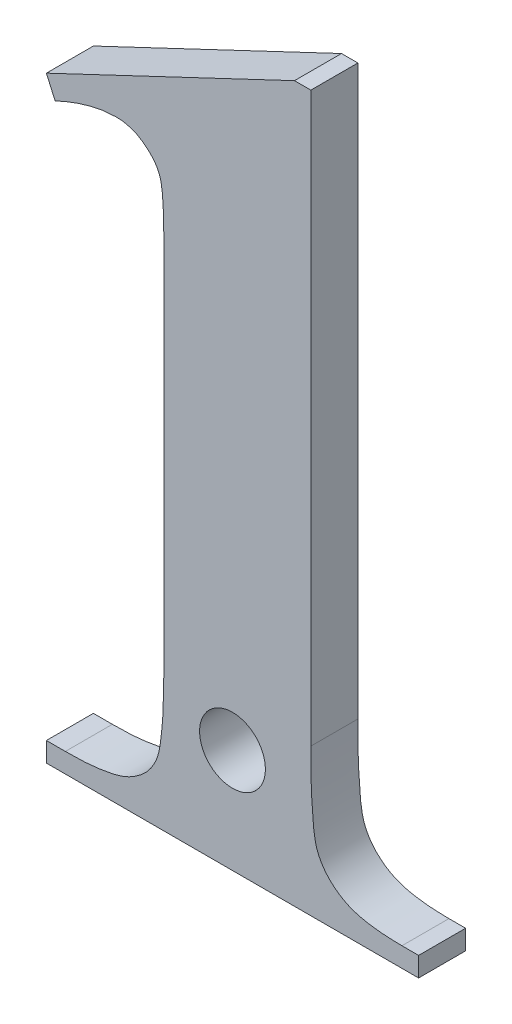
ISO-10303-21;
HEADER;
FILE_DESCRIPTION(('STEP AP214'),'2;1');
FILE_NAME('part.step','',(''),(''),'','','');
FILE_SCHEMA(('AUTOMOTIVE_DESIGN { 1 0 10303 214 1 1 1 1 }'));
ENDSEC;
DATA;
#1=APPLICATION_CONTEXT('core data for automotive mechanical design processes');
#2=APPLICATION_PROTOCOL_DEFINITION('international standard','automotive_design',2000,#1);
#3=PRODUCT_CONTEXT('',#1,'mechanical');
#4=PRODUCT('Part','Part','',(#3));
#5=PRODUCT_RELATED_PRODUCT_CATEGORY('part','',(#4));
#6=PRODUCT_DEFINITION_FORMATION('','',#4);
#7=PRODUCT_DEFINITION_CONTEXT('part definition',#1,'design');
#8=PRODUCT_DEFINITION('design','',#6,#7);
#9=PRODUCT_DEFINITION_SHAPE('','',#8);
#10=(LENGTH_UNIT() NAMED_UNIT(*) SI_UNIT(.MILLI.,.METRE.));
#11=(NAMED_UNIT(*) PLANE_ANGLE_UNIT() SI_UNIT($,.RADIAN.));
#12=(NAMED_UNIT(*) SI_UNIT($,.STERADIAN.) SOLID_ANGLE_UNIT());
#13=UNCERTAINTY_MEASURE_WITH_UNIT(LENGTH_MEASURE(1.E-05),#10,'distance_accuracy_value','');
#14=(GEOMETRIC_REPRESENTATION_CONTEXT(3) GLOBAL_UNCERTAINTY_ASSIGNED_CONTEXT((#13)) GLOBAL_UNIT_ASSIGNED_CONTEXT((#10,
#11,#12)) REPRESENTATION_CONTEXT('',''));
#15=CARTESIAN_POINT('',(0.,0.,0.));
#16=DIRECTION('',(0.,0.,1.));
#17=DIRECTION('',(1.,0.,0.));
#18=AXIS2_PLACEMENT_3D('',#15,#16,#17);
#19=CARTESIAN_POINT('',(13.88671875,30.4166666666667,2.));
#20=DIRECTION('',(0.,1.,0.));
#21=DIRECTION('',(0.,0.,1.));
#22=AXIS2_PLACEMENT_3D('',#19,#20,#21);
#23=PLANE('',#22);
#24=DIRECTION('',(1.,0.,0.));
#25=VECTOR('',#24,1.);
#26=CARTESIAN_POINT('',(13.88671875,30.4166666666667,0.));
#27=LINE('',#26,#25);
#28=CARTESIAN_POINT('',(13.88671875,30.4166666666667,0.));
#29=VERTEX_POINT('',#28);
#30=CARTESIAN_POINT('',(14.5833333333333,30.4166666666667,0.));
#31=VERTEX_POINT('',#30);
#32=EDGE_CURVE('E242',#29,#31,#27,.T.);
#33=ORIENTED_EDGE('',*,*,#32,.F.);
#34=DIRECTION('',(0.,0.,-1.));
#35=VECTOR('',#34,1.);
#36=CARTESIAN_POINT('',(13.88671875,30.4166666666667,2.));
#37=LINE('',#36,#35);
#38=CARTESIAN_POINT('',(13.88671875,30.4166666666667,2.));
#39=VERTEX_POINT('',#38);
#40=EDGE_CURVE('E11',#39,#29,#37,.T.);
#41=ORIENTED_EDGE('',*,*,#40,.F.);
#42=DIRECTION('',(1.,0.,0.));
#43=VECTOR('',#42,1.);
#44=CARTESIAN_POINT('',(13.88671875,30.4166666666667,2.));
#45=LINE('',#44,#43);
#46=CARTESIAN_POINT('',(14.5833333333333,30.4166666666667,2.));
#47=VERTEX_POINT('',#46);
#48=EDGE_CURVE('E297',#39,#47,#45,.T.);
#49=ORIENTED_EDGE('',*,*,#48,.T.);
#50=DIRECTION('',(0.,0.,-1.));
#51=VECTOR('',#50,1.);
#52=CARTESIAN_POINT('',(14.5833333333333,30.4166666666667,2.));
#53=LINE('',#52,#51);
#54=EDGE_CURVE('E111',#47,#31,#53,.T.);
#55=ORIENTED_EDGE('',*,*,#54,.T.);
#56=EDGE_LOOP('',(#33,#41,#49,#55));
#57=FACE_BOUND('',#56,.T.);
#58=ADVANCED_FACE('F37',(#57),#23,.T.);
#59=CARTESIAN_POINT('',(3.33333333333333,25.4166666666667,2.));
#60=DIRECTION('',(-0.428158237884948,0.903703780744142,0.));
#61=DIRECTION('',(-0.903703780744142,-0.428158237884948,0.));
#62=AXIS2_PLACEMENT_3D('',#59,#60,#61);
#63=PLANE('',#62);
#64=DIRECTION('',(0.903703780744142,0.428158237884948,0.));
#65=VECTOR('',#64,1.);
#66=CARTESIAN_POINT('',(3.33333333333333,25.4166666666667,0.));
#67=LINE('',#66,#65);
#68=CARTESIAN_POINT('',(3.33333333333333,25.4166666666667,0.));
#69=VERTEX_POINT('',#68);
#70=EDGE_CURVE('E295',#69,#29,#67,.T.);
#71=ORIENTED_EDGE('',*,*,#70,.F.);
#72=DIRECTION('',(0.,0.,-1.));
#73=VECTOR('',#72,1.);
#74=CARTESIAN_POINT('',(3.33333333333333,25.4166666666667,2.));
#75=LINE('',#74,#73);
#76=CARTESIAN_POINT('',(3.33333333333333,25.4166666666667,2.));
#77=VERTEX_POINT('',#76);
#78=EDGE_CURVE('E46',#77,#69,#75,.T.);
#79=ORIENTED_EDGE('',*,*,#78,.F.);
#80=DIRECTION('',(0.903703780744142,0.428158237884948,0.));
#81=VECTOR('',#80,1.);
#82=CARTESIAN_POINT('',(3.33333333333333,25.4166666666667,2.));
#83=LINE('',#82,#81);
#84=EDGE_CURVE('E161',#77,#39,#83,.T.);
#85=ORIENTED_EDGE('',*,*,#84,.T.);
#86=ORIENTED_EDGE('',*,*,#40,.T.);
#87=EDGE_LOOP('',(#71,#79,#85,#86));
#88=FACE_BOUND('',#87,.T.);
#89=ADVANCED_FACE('F345',(#88),#63,.T.);
#90=CARTESIAN_POINT('',(3.70442708333333,24.5833333333333,2.));
#91=DIRECTION('',(-0.913517005540234,-0.406800541529636,0.));
#92=DIRECTION('',(0.406800541529636,-0.913517005540234,0.));
#93=AXIS2_PLACEMENT_3D('',#90,#91,#92);
#94=PLANE('',#93);
#95=DIRECTION('',(-0.406800541529636,0.913517005540234,0.));
#96=VECTOR('',#95,1.);
#97=CARTESIAN_POINT('',(3.70442708333333,24.5833333333333,0.));
#98=LINE('',#97,#96);
#99=CARTESIAN_POINT('',(3.70442708333333,24.5833333333333,0.));
#100=VERTEX_POINT('',#99);
#101=EDGE_CURVE('E148',#100,#69,#98,.T.);
#102=ORIENTED_EDGE('',*,*,#101,.F.);
#103=DIRECTION('',(0.,0.,-1.));
#104=VECTOR('',#103,1.);
#105=CARTESIAN_POINT('',(3.70442708333333,24.5833333333333,2.));
#106=LINE('',#105,#104);
#107=CARTESIAN_POINT('',(3.70442708333333,24.5833333333333,2.));
#108=VERTEX_POINT('',#107);
#109=EDGE_CURVE('E143',#108,#100,#106,.T.);
#110=ORIENTED_EDGE('',*,*,#109,.F.);
#111=DIRECTION('',(-0.406800541529636,0.913517005540234,0.));
#112=VECTOR('',#111,1.);
#113=CARTESIAN_POINT('',(3.70442708333333,24.5833333333333,2.));
#114=LINE('',#113,#112);
#115=EDGE_CURVE('E146',#108,#77,#114,.T.);
#116=ORIENTED_EDGE('',*,*,#115,.T.);
#117=ORIENTED_EDGE('',*,*,#78,.T.);
#118=EDGE_LOOP('',(#102,#110,#116,#117));
#119=FACE_BOUND('',#118,.T.);
#120=ADVANCED_FACE('F145',(#119),#94,.T.);
#121=CARTESIAN_POINT('',(6.28255208333333,25.2864583333333,2.));
#122=CARTESIAN_POINT('',(6.09528548634045,25.2762868200632,2.));
#123=CARTESIAN_POINT('',(5.69944020216043,25.2547862127707,2.));
#124=CARTESIAN_POINT('',(5.07973429430935,25.1127396875846,2.));
#125=CARTESIAN_POINT('',(4.40475644061361,24.8914102218062,2.));
#126=CARTESIAN_POINT('',(3.94585080896513,24.6895363211461,2.));
#127=CARTESIAN_POINT('',(3.70442708333333,24.5833333333333,2.));
#128=B_SPLINE_CURVE_WITH_KNOTS('',3,(#121,#122,#123,#124,#125,#126,#127),.UNSPECIFIED.,.F.,.F.,
(4,1,1,1,4),(0.,0.208786076095189,0.441333291424464,0.706093390734255,1.),.UNSPECIFIED.);
#129=DIRECTION('',(0.,0.,-1.));
#130=VECTOR('',#129,1.);
#131=SURFACE_OF_LINEAR_EXTRUSION('',#128,#130);
#132=CARTESIAN_POINT('',(6.28255208333333,25.2864583333333,0.));
#133=CARTESIAN_POINT('',(6.09528548634045,25.2762868200632,0.));
#134=CARTESIAN_POINT('',(5.69944020216043,25.2547862127707,0.));
#135=CARTESIAN_POINT('',(5.07973429430935,25.1127396875846,0.));
#136=CARTESIAN_POINT('',(4.40475644061361,24.8914102218062,0.));
#137=CARTESIAN_POINT('',(3.94585080896513,24.6895363211461,0.));
#138=CARTESIAN_POINT('',(3.70442708333333,24.5833333333333,0.));
#139=B_SPLINE_CURVE_WITH_KNOTS('',3,(#132,#133,#134,#135,#136,#137,#138),.UNSPECIFIED.,.F.,.F.,
(4,1,1,1,4),(0.,0.208786076095189,0.441333291424464,0.706093390734255,1.),.UNSPECIFIED.);
#140=CARTESIAN_POINT('',(6.28255208333333,25.2864583333333,0.));
#141=VERTEX_POINT('',#140);
#142=EDGE_CURVE('E284',#141,#100,#139,.T.);
#143=ORIENTED_EDGE('',*,*,#142,.F.);
#144=DIRECTION('',(0.,0.,-1.));
#145=VECTOR('',#144,1.);
#146=CARTESIAN_POINT('',(6.28255208333333,25.2864583333333,2.));
#147=LINE('',#146,#145);
#148=CARTESIAN_POINT('',(6.28255208333333,25.2864583333333,2.));
#149=VERTEX_POINT('',#148);
#150=EDGE_CURVE('E153',#149,#141,#147,.T.);
#151=ORIENTED_EDGE('',*,*,#150,.F.);
#152=EDGE_CURVE('E159',#149,#108,#128,.T.);
#153=ORIENTED_EDGE('',*,*,#152,.T.);
#154=ORIENTED_EDGE('',*,*,#109,.T.);
#155=EDGE_LOOP('',(#143,#151,#153,#154));
#156=FACE_BOUND('',#155,.T.);
#157=ADVANCED_FACE('F163',(#156),#131,.T.);
#158=CARTESIAN_POINT('',(8.33333333333334,21.6666666666667,2.));
#159=CARTESIAN_POINT('',(8.33080108390352,21.9596609901821,2.));
#160=CARTESIAN_POINT('',(8.32627855740709,22.482940638624,2.));
#161=CARTESIAN_POINT('',(8.29725870715574,23.1784409327244,2.));
#162=CARTESIAN_POINT('',(8.24784792939964,23.6933741016548,2.));
#163=CARTESIAN_POINT('',(8.14560970749298,24.1459081075292,2.));
#164=CARTESIAN_POINT('',(7.88550838436045,24.5657235631178,2.));
#165=CARTESIAN_POINT('',(7.52713471898203,24.8750089374527,2.));
#166=CARTESIAN_POINT('',(7.19301513725832,25.0957238535574,2.));
#167=CARTESIAN_POINT('',(6.90205117506411,25.199461425439,2.));
#168=CARTESIAN_POINT('',(6.59939561277898,25.2798856871215,2.));
#169=CARTESIAN_POINT('',(6.38946957702167,25.2842404219842,2.));
#170=CARTESIAN_POINT('',(6.28255208333333,25.2864583333333,2.));
#171=B_SPLINE_CURVE_WITH_KNOTS('',3,(#158,#159,#160,#161,#162,#163,#164,#165,#166,#167,#168,
#169,#170),.UNSPECIFIED.,.F.,.F.,(4,1,1,1,1,1,1,1,1,1,4),(0.,0.18407895113879,0.328759846544913,
0.437165006450407,0.508921728810424,0.6183508896611,0.739961115744406,0.804272479082141,
0.868583842419875,0.933068396457201,1.),.UNSPECIFIED.);
#172=DIRECTION('',(0.,0.,-1.));
#173=VECTOR('',#172,1.);
#174=SURFACE_OF_LINEAR_EXTRUSION('',#171,#173);
#175=CARTESIAN_POINT('',(8.33333333333334,21.6666666666667,0.));
#176=CARTESIAN_POINT('',(8.33080108390352,21.9596609901821,0.));
#177=CARTESIAN_POINT('',(8.32627855740709,22.482940638624,0.));
#178=CARTESIAN_POINT('',(8.29725870715574,23.1784409327244,0.));
#179=CARTESIAN_POINT('',(8.24784792939964,23.6933741016548,0.));
#180=CARTESIAN_POINT('',(8.14560970749298,24.1459081075292,0.));
#181=CARTESIAN_POINT('',(7.88550838436045,24.5657235631178,0.));
#182=CARTESIAN_POINT('',(7.52713471898203,24.8750089374527,0.));
#183=CARTESIAN_POINT('',(7.19301513725832,25.0957238535574,0.));
#184=CARTESIAN_POINT('',(6.90205117506411,25.199461425439,0.));
#185=CARTESIAN_POINT('',(6.59939561277898,25.2798856871215,0.));
#186=CARTESIAN_POINT('',(6.38946957702167,25.2842404219842,0.));
#187=CARTESIAN_POINT('',(6.28255208333333,25.2864583333333,0.));
#188=B_SPLINE_CURVE_WITH_KNOTS('',3,(#175,#176,#177,#178,#179,#180,#181,#182,#183,#184,#185,
#186,#187),.UNSPECIFIED.,.F.,.F.,(4,1,1,1,1,1,1,1,1,1,4),(0.,0.18407895113879,0.328759846544913,
0.437165006450407,0.508921728810424,0.6183508896611,0.739961115744406,0.804272479082141,
0.868583842419875,0.933068396457201,1.),.UNSPECIFIED.);
#189=CARTESIAN_POINT('',(8.33333333333333,21.6666666666667,0.));
#190=VERTEX_POINT('',#189);
#191=EDGE_CURVE('E279',#190,#141,#188,.T.);
#192=ORIENTED_EDGE('',*,*,#191,.F.);
#193=DIRECTION('',(0.,0.,-1.));
#194=VECTOR('',#193,1.);
#195=CARTESIAN_POINT('',(8.33333333333333,21.6666666666667,2.));
#196=LINE('',#195,#194);
#197=CARTESIAN_POINT('',(8.33333333333333,21.6666666666667,2.));
#198=VERTEX_POINT('',#197);
#199=EDGE_CURVE('E213',#198,#190,#196,.T.);
#200=ORIENTED_EDGE('',*,*,#199,.F.);
#201=EDGE_CURVE('E164',#198,#149,#171,.T.);
#202=ORIENTED_EDGE('',*,*,#201,.T.);
#203=ORIENTED_EDGE('',*,*,#150,.T.);
#204=EDGE_LOOP('',(#192,#200,#202,#203));
#205=FACE_BOUND('',#204,.T.);
#206=ADVANCED_FACE('F183',(#205),#174,.T.);
#207=CARTESIAN_POINT('',(8.33333333333333,6.25,2.));
#208=DIRECTION('',(-1.,0.,0.));
#209=DIRECTION('',(0.,0.,1.));
#210=AXIS2_PLACEMENT_3D('',#207,#208,#209);
#211=PLANE('',#210);
#212=DIRECTION('',(0.,1.,0.));
#213=VECTOR('',#212,1.);
#214=CARTESIAN_POINT('',(8.33333333333333,6.25,0.));
#215=LINE('',#214,#213);
#216=CARTESIAN_POINT('',(8.33333333333333,6.25,0.));
#217=VERTEX_POINT('',#216);
#218=EDGE_CURVE('E273',#217,#190,#215,.T.);
#219=ORIENTED_EDGE('',*,*,#218,.F.);
#220=DIRECTION('',(0.,0.,-1.));
#221=VECTOR('',#220,1.);
#222=CARTESIAN_POINT('',(8.33333333333333,6.25,2.));
#223=LINE('',#222,#221);
#224=CARTESIAN_POINT('',(8.33333333333333,6.25,2.));
#225=VERTEX_POINT('',#224);
#226=EDGE_CURVE('E215',#225,#217,#223,.T.);
#227=ORIENTED_EDGE('',*,*,#226,.F.);
#228=DIRECTION('',(0.,1.,0.));
#229=VECTOR('',#228,1.);
#230=CARTESIAN_POINT('',(8.33333333333333,6.25,2.));
#231=LINE('',#230,#229);
#232=EDGE_CURVE('E166',#225,#198,#231,.T.);
#233=ORIENTED_EDGE('',*,*,#232,.T.);
#234=ORIENTED_EDGE('',*,*,#199,.T.);
#235=EDGE_LOOP('',(#219,#227,#233,#234));
#236=FACE_BOUND('',#235,.T.);
#237=ADVANCED_FACE('F187',(#236),#211,.T.);
#238=CARTESIAN_POINT('',(4.140625,0.833333333333333,2.));
#239=CARTESIAN_POINT('',(4.44269832822936,0.835687662820954,2.));
#240=CARTESIAN_POINT('',(5.00289969445067,0.840053816573194,2.));
#241=CARTESIAN_POINT('',(5.77053000660346,0.936228913351695,2.));
#242=CARTESIAN_POINT('',(6.40663293899833,1.05647620460576,2.));
#243=CARTESIAN_POINT('',(6.90743442266359,1.26421840183116,2.));
#244=CARTESIAN_POINT('',(7.29956338426935,1.52426400905717,2.));
#245=CARTESIAN_POINT('',(7.62397689921054,1.81310173018365,2.));
#246=CARTESIAN_POINT('',(7.86920920006465,2.1584167643376,2.));
#247=CARTESIAN_POINT('',(8.02828269326665,2.48159017036424,2.));
#248=CARTESIAN_POINT('',(8.12157587335946,2.79175815888585,2.));
#249=CARTESIAN_POINT('',(8.17780450558004,3.09290722562538,2.));
#250=CARTESIAN_POINT('',(8.21823451497787,3.45896491247355,2.));
#251=CARTESIAN_POINT('',(8.26778014170685,3.88796438641833,2.));
#252=CARTESIAN_POINT('',(8.29803813466738,4.38550207219121,2.));
#253=CARTESIAN_POINT('',(8.31519165680198,4.94781576782706,2.));
#254=CARTESIAN_POINT('',(8.32880699917369,5.57719863190302,2.));
#255=CARTESIAN_POINT('',(8.33177110184049,6.0177874746771,2.));
#256=CARTESIAN_POINT('',(8.33333333333333,6.25,2.));
#257=B_SPLINE_CURVE_WITH_KNOTS('',3,(#238,#239,#240,#241,#242,#243,#244,#245,#246,#247,#248,
#249,#250,#251,#252,#253,#254,#255,#256),.UNSPECIFIED.,.F.,.F.,(4,1,1,1,1,1,1,1,1,1,1,1,1,1,1,1,
4),(0.,0.109216386650297,0.202544095415127,0.279725800942301,0.342739505157038,
0.397199235296946,0.449450759106201,0.498937460796919,0.549521397963843,0.579086418201098,
0.615900017759338,0.660224939125551,0.712352356895176,0.772172119916255,0.840542903289929,
0.915958073575891,1.),.UNSPECIFIED.);
#258=DIRECTION('',(0.,0.,-1.));
#259=VECTOR('',#258,1.);
#260=SURFACE_OF_LINEAR_EXTRUSION('',#257,#259);
#261=CARTESIAN_POINT('',(4.140625,0.833333333333333,0.));
#262=CARTESIAN_POINT('',(4.44269832822936,0.835687662820954,0.));
#263=CARTESIAN_POINT('',(5.00289969445067,0.840053816573194,0.));
#264=CARTESIAN_POINT('',(5.77053000660346,0.936228913351695,0.));
#265=CARTESIAN_POINT('',(6.40663293899833,1.05647620460576,0.));
#266=CARTESIAN_POINT('',(6.90743442266359,1.26421840183116,0.));
#267=CARTESIAN_POINT('',(7.29956338426935,1.52426400905717,0.));
#268=CARTESIAN_POINT('',(7.62397689921054,1.81310173018365,0.));
#269=CARTESIAN_POINT('',(7.86920920006465,2.1584167643376,0.));
#270=CARTESIAN_POINT('',(8.02828269326665,2.48159017036424,0.));
#271=CARTESIAN_POINT('',(8.12157587335946,2.79175815888585,0.));
#272=CARTESIAN_POINT('',(8.17780450558004,3.09290722562538,0.));
#273=CARTESIAN_POINT('',(8.21823451497787,3.45896491247355,0.));
#274=CARTESIAN_POINT('',(8.26778014170685,3.88796438641833,0.));
#275=CARTESIAN_POINT('',(8.29803813466738,4.38550207219121,0.));
#276=CARTESIAN_POINT('',(8.31519165680198,4.94781576782706,0.));
#277=CARTESIAN_POINT('',(8.32880699917369,5.57719863190302,0.));
#278=CARTESIAN_POINT('',(8.33177110184049,6.0177874746771,0.));
#279=CARTESIAN_POINT('',(8.33333333333333,6.25,0.));
#280=B_SPLINE_CURVE_WITH_KNOTS('',3,(#261,#262,#263,#264,#265,#266,#267,#268,#269,#270,#271,
#272,#273,#274,#275,#276,#277,#278,#279),.UNSPECIFIED.,.F.,.F.,(4,1,1,1,1,1,1,1,1,1,1,1,1,1,1,1,
4),(0.,0.109216386650297,0.202544095415127,0.279725800942301,0.342739505157038,
0.397199235296946,0.449450759106201,0.498937460796919,0.549521397963843,0.579086418201098,
0.615900017759338,0.660224939125551,0.712352356895176,0.772172119916255,0.840542903289929,
0.915958073575891,1.),.UNSPECIFIED.);
#281=CARTESIAN_POINT('',(4.140625,0.833333333333333,0.));
#282=VERTEX_POINT('',#281);
#283=EDGE_CURVE('E222',#282,#217,#280,.T.);
#284=ORIENTED_EDGE('',*,*,#283,.F.);
#285=DIRECTION('',(0.,0.,-1.));
#286=VECTOR('',#285,1.);
#287=CARTESIAN_POINT('',(4.140625,0.833333333333333,2.));
#288=LINE('',#287,#286);
#289=CARTESIAN_POINT('',(4.140625,0.833333333333333,2.));
#290=VERTEX_POINT('',#289);
#291=EDGE_CURVE('E220',#290,#282,#288,.T.);
#292=ORIENTED_EDGE('',*,*,#291,.F.);
#293=EDGE_CURVE('E199',#290,#225,#257,.T.);
#294=ORIENTED_EDGE('',*,*,#293,.T.);
#295=ORIENTED_EDGE('',*,*,#226,.T.);
#296=EDGE_LOOP('',(#284,#292,#294,#295));
#297=FACE_BOUND('',#296,.T.);
#298=ADVANCED_FACE('F191',(#297),#260,.T.);
#299=CARTESIAN_POINT('',(3.33333333333333,0.833333333333333,2.));
#300=DIRECTION('',(0.,1.,0.));
#301=DIRECTION('',(0.,0.,1.));
#302=AXIS2_PLACEMENT_3D('',#299,#300,#301);
#303=PLANE('',#302);
#304=DIRECTION('',(1.,0.,0.));
#305=VECTOR('',#304,1.);
#306=CARTESIAN_POINT('',(3.33333333333333,0.833333333333333,0.));
#307=LINE('',#306,#305);
#308=CARTESIAN_POINT('',(3.33333333333333,0.833333333333333,0.));
#309=VERTEX_POINT('',#308);
#310=EDGE_CURVE('E268',#309,#282,#307,.T.);
#311=ORIENTED_EDGE('',*,*,#310,.F.);
#312=DIRECTION('',(0.,0.,-1.));
#313=VECTOR('',#312,1.);
#314=CARTESIAN_POINT('',(3.33333333333333,0.833333333333333,2.));
#315=LINE('',#314,#313);
#316=CARTESIAN_POINT('',(3.33333333333333,0.833333333333333,2.));
#317=VERTEX_POINT('',#316);
#318=EDGE_CURVE('E226',#317,#309,#315,.T.);
#319=ORIENTED_EDGE('',*,*,#318,.F.);
#320=DIRECTION('',(1.,0.,0.));
#321=VECTOR('',#320,1.);
#322=CARTESIAN_POINT('',(3.33333333333333,0.833333333333333,2.));
#323=LINE('',#322,#321);
#324=EDGE_CURVE('E205',#317,#290,#323,.T.);
#325=ORIENTED_EDGE('',*,*,#324,.T.);
#326=ORIENTED_EDGE('',*,*,#291,.T.);
#327=EDGE_LOOP('',(#311,#319,#325,#326));
#328=FACE_BOUND('',#327,.T.);
#329=ADVANCED_FACE('F196',(#328),#303,.T.);
#330=CARTESIAN_POINT('',(3.33333333333333,0.,2.));
#331=DIRECTION('',(-1.,0.,0.));
#332=DIRECTION('',(0.,0.,1.));
#333=AXIS2_PLACEMENT_3D('',#330,#331,#332);
#334=PLANE('',#333);
#335=DIRECTION('',(0.,1.,0.));
#336=VECTOR('',#335,1.);
#337=CARTESIAN_POINT('',(3.33333333333333,0.,0.));
#338=LINE('',#337,#336);
#339=CARTESIAN_POINT('',(3.33333333333333,0.,0.));
#340=VERTEX_POINT('',#339);
#341=EDGE_CURVE('E265',#340,#309,#338,.T.);
#342=ORIENTED_EDGE('',*,*,#341,.F.);
#343=DIRECTION('',(0.,0.,-1.));
#344=VECTOR('',#343,1.);
#345=CARTESIAN_POINT('',(3.33333333333333,0.,2.));
#346=LINE('',#345,#344);
#347=CARTESIAN_POINT('',(3.33333333333333,0.,2.));
#348=VERTEX_POINT('',#347);
#349=EDGE_CURVE('E229',#348,#340,#346,.T.);
#350=ORIENTED_EDGE('',*,*,#349,.F.);
#351=DIRECTION('',(0.,1.,0.));
#352=VECTOR('',#351,1.);
#353=CARTESIAN_POINT('',(3.33333333333333,0.,2.));
#354=LINE('',#353,#352);
#355=EDGE_CURVE('E307',#348,#317,#354,.T.);
#356=ORIENTED_EDGE('',*,*,#355,.T.);
#357=ORIENTED_EDGE('',*,*,#318,.T.);
#358=EDGE_LOOP('',(#342,#350,#356,#357));
#359=FACE_BOUND('',#358,.T.);
#360=ADVANCED_FACE('F309',(#359),#334,.T.);
#361=CARTESIAN_POINT('',(19.1666666666667,0.,2.));
#362=DIRECTION('',(0.,-1.,0.));
#363=DIRECTION('',(0.,0.,-1.));
#364=AXIS2_PLACEMENT_3D('',#361,#362,#363);
#365=PLANE('',#364);
#366=DIRECTION('',(-1.,0.,0.));
#367=VECTOR('',#366,1.);
#368=CARTESIAN_POINT('',(19.1666666666667,0.,0.));
#369=LINE('',#368,#367);
#370=CARTESIAN_POINT('',(19.1666666666667,0.,0.));
#371=VERTEX_POINT('',#370);
#372=EDGE_CURVE('E262',#371,#340,#369,.T.);
#373=ORIENTED_EDGE('',*,*,#372,.F.);
#374=DIRECTION('',(0.,0.,-1.));
#375=VECTOR('',#374,1.);
#376=CARTESIAN_POINT('',(19.1666666666667,0.,2.));
#377=LINE('',#376,#375);
#378=CARTESIAN_POINT('',(19.1666666666667,0.,2.));
#379=VERTEX_POINT('',#378);
#380=EDGE_CURVE('E234',#379,#371,#377,.T.);
#381=ORIENTED_EDGE('',*,*,#380,.F.);
#382=DIRECTION('',(-1.,0.,0.));
#383=VECTOR('',#382,1.);
#384=CARTESIAN_POINT('',(19.1666666666667,0.,2.));
#385=LINE('',#384,#383);
#386=EDGE_CURVE('E310',#379,#348,#385,.T.);
#387=ORIENTED_EDGE('',*,*,#386,.T.);
#388=ORIENTED_EDGE('',*,*,#349,.T.);
#389=EDGE_LOOP('',(#373,#381,#387,#388));
#390=FACE_BOUND('',#389,.T.);
#391=ADVANCED_FACE('F360',(#390),#365,.T.);
#392=CARTESIAN_POINT('',(19.1666666666667,0.833333333333333,2.));
#393=DIRECTION('',(1.,0.,0.));
#394=DIRECTION('',(0.,0.,-1.));
#395=AXIS2_PLACEMENT_3D('',#392,#393,#394);
#396=PLANE('',#395);
#397=DIRECTION('',(0.,-1.,0.));
#398=VECTOR('',#397,1.);
#399=CARTESIAN_POINT('',(19.1666666666667,0.833333333333333,0.));
#400=LINE('',#399,#398);
#401=CARTESIAN_POINT('',(19.1666666666667,0.833333333333333,0.));
#402=VERTEX_POINT('',#401);
#403=EDGE_CURVE('E259',#402,#371,#400,.T.);
#404=ORIENTED_EDGE('',*,*,#403,.F.);
#405=DIRECTION('',(0.,0.,-1.));
#406=VECTOR('',#405,1.);
#407=CARTESIAN_POINT('',(19.1666666666667,0.833333333333333,2.));
#408=LINE('',#407,#406);
#409=CARTESIAN_POINT('',(19.1666666666667,0.833333333333333,2.));
#410=VERTEX_POINT('',#409);
#411=EDGE_CURVE('E236',#410,#402,#408,.T.);
#412=ORIENTED_EDGE('',*,*,#411,.F.);
#413=DIRECTION('',(0.,-1.,0.));
#414=VECTOR('',#413,1.);
#415=CARTESIAN_POINT('',(19.1666666666667,0.833333333333333,2.));
#416=LINE('',#415,#414);
#417=EDGE_CURVE('E311',#410,#379,#416,.T.);
#418=ORIENTED_EDGE('',*,*,#417,.T.);
#419=ORIENTED_EDGE('',*,*,#380,.T.);
#420=EDGE_LOOP('',(#404,#412,#418,#419));
#421=FACE_BOUND('',#420,.T.);
#422=ADVANCED_FACE('F357',(#421),#396,.T.);
#423=CARTESIAN_POINT('',(18.45703125,0.833333333333333,2.));
#424=DIRECTION('',(0.,1.,0.));
#425=DIRECTION('',(0.,0.,1.));
#426=AXIS2_PLACEMENT_3D('',#423,#424,#425);
#427=PLANE('',#426);
#428=DIRECTION('',(1.,0.,0.));
#429=VECTOR('',#428,1.);
#430=CARTESIAN_POINT('',(18.45703125,0.833333333333333,0.));
#431=LINE('',#430,#429);
#432=CARTESIAN_POINT('',(18.45703125,0.833333333333333,0.));
#433=VERTEX_POINT('',#432);
#434=EDGE_CURVE('E253',#433,#402,#431,.T.);
#435=ORIENTED_EDGE('',*,*,#434,.F.);
#436=DIRECTION('',(0.,0.,-1.));
#437=VECTOR('',#436,1.);
#438=CARTESIAN_POINT('',(18.45703125,0.833333333333333,2.));
#439=LINE('',#438,#437);
#440=CARTESIAN_POINT('',(18.45703125,0.833333333333333,2.));
#441=VERTEX_POINT('',#440);
#442=EDGE_CURVE('E238',#441,#433,#439,.T.);
#443=ORIENTED_EDGE('',*,*,#442,.F.);
#444=DIRECTION('',(1.,0.,0.));
#445=VECTOR('',#444,1.);
#446=CARTESIAN_POINT('',(18.45703125,0.833333333333333,2.));
#447=LINE('',#446,#445);
#448=EDGE_CURVE('E316',#441,#410,#447,.T.);
#449=ORIENTED_EDGE('',*,*,#448,.T.);
#450=ORIENTED_EDGE('',*,*,#411,.T.);
#451=EDGE_LOOP('',(#435,#443,#449,#450));
#452=FACE_BOUND('',#451,.T.);
#453=ADVANCED_FACE('F335',(#452),#427,.T.);
#454=CARTESIAN_POINT('',(14.5833333333333,6.25,2.));
#455=CARTESIAN_POINT('',(14.5857492555619,6.02430808425118,2.));
#456=CARTESIAN_POINT('',(14.5903720500696,5.5924533928183,2.));
#457=CARTESIAN_POINT('',(14.5931073665251,4.97816178303441,2.));
#458=CARTESIAN_POINT('',(14.6114050282873,4.42661613567029,2.));
#459=CARTESIAN_POINT('',(14.6469813060851,3.94084613788989,2.));
#460=CARTESIAN_POINT('',(14.6773954405156,3.51733667408537,2.));
#461=CARTESIAN_POINT('',(14.7129444077539,3.15810102380661,2.));
#462=CARTESIAN_POINT('',(14.7651444600165,2.86487643536985,2.));
#463=CARTESIAN_POINT('',(14.8388885812354,2.56040674809926,2.));
#464=CARTESIAN_POINT('',(14.984413764,2.23974881835138,2.));
#465=CARTESIAN_POINT('',(15.2149607921076,1.89373362130113,2.));
#466=CARTESIAN_POINT('',(15.5196309064702,1.5879154394786,2.));
#467=CARTESIAN_POINT('',(15.8945058501009,1.31092285730282,2.));
#468=CARTESIAN_POINT('',(16.371078343683,1.08488828945006,2.));
#469=CARTESIAN_POINT('',(16.9651438182382,0.937715106640767,2.));
#470=CARTESIAN_POINT('',(17.6731536174895,0.850195969455398,2.));
#471=CARTESIAN_POINT('',(18.1832960527179,0.839221876179985,2.));
#472=CARTESIAN_POINT('',(18.45703125,0.833333333333333,2.));
#473=B_SPLINE_CURVE_WITH_KNOTS('',3,(#454,#455,#456,#457,#458,#459,#460,#461,#462,#463,#464,
#465,#466,#467,#468,#469,#470,#471,#472),.UNSPECIFIED.,.F.,.F.,(4,1,1,1,1,1,1,1,1,1,1,1,1,1,1,1,
4),(0.,0.0847252367891059,0.162119191858238,0.230591577524457,0.291824304405096,0.3449315578391,
0.390001919312784,0.427234967843538,0.456674504123847,0.507378149526924,0.558440451641188,
0.612014249206323,0.668553194096084,0.732681552760434,0.808560124589107,0.897276077337482,1.),.UNSPECIFIED.);
#474=DIRECTION('',(0.,0.,-1.));
#475=VECTOR('',#474,1.);
#476=SURFACE_OF_LINEAR_EXTRUSION('',#473,#475);
#477=CARTESIAN_POINT('',(14.5833333333333,6.25,0.));
#478=CARTESIAN_POINT('',(14.5857492555619,6.02430808425118,0.));
#479=CARTESIAN_POINT('',(14.5903720500696,5.5924533928183,0.));
#480=CARTESIAN_POINT('',(14.5931073665251,4.97816178303441,0.));
#481=CARTESIAN_POINT('',(14.6114050282873,4.42661613567029,0.));
#482=CARTESIAN_POINT('',(14.6469813060851,3.94084613788989,0.));
#483=CARTESIAN_POINT('',(14.6773954405156,3.51733667408537,0.));
#484=CARTESIAN_POINT('',(14.7129444077539,3.15810102380661,0.));
#485=CARTESIAN_POINT('',(14.7651444600165,2.86487643536985,0.));
#486=CARTESIAN_POINT('',(14.8388885812354,2.56040674809926,0.));
#487=CARTESIAN_POINT('',(14.984413764,2.23974881835138,0.));
#488=CARTESIAN_POINT('',(15.2149607921076,1.89373362130113,0.));
#489=CARTESIAN_POINT('',(15.5196309064702,1.5879154394786,0.));
#490=CARTESIAN_POINT('',(15.8945058501009,1.31092285730282,0.));
#491=CARTESIAN_POINT('',(16.371078343683,1.08488828945006,0.));
#492=CARTESIAN_POINT('',(16.9651438182382,0.937715106640767,0.));
#493=CARTESIAN_POINT('',(17.6731536174895,0.850195969455398,0.));
#494=CARTESIAN_POINT('',(18.1832960527179,0.839221876179985,0.));
#495=CARTESIAN_POINT('',(18.45703125,0.833333333333333,0.));
#496=B_SPLINE_CURVE_WITH_KNOTS('',3,(#477,#478,#479,#480,#481,#482,#483,#484,#485,#486,#487,
#488,#489,#490,#491,#492,#493,#494,#495),.UNSPECIFIED.,.F.,.F.,(4,1,1,1,1,1,1,1,1,1,1,1,1,1,1,1,
4),(0.,0.0847252367891059,0.162119191858238,0.230591577524457,0.291824304405096,0.3449315578391,
0.390001919312784,0.427234967843538,0.456674504123847,0.507378149526924,0.558440451641188,
0.612014249206323,0.668553194096084,0.732681552760434,0.808560124589107,0.897276077337482,1.),.UNSPECIFIED.);
#497=CARTESIAN_POINT('',(14.5833333333333,6.25,0.));
#498=VERTEX_POINT('',#497);
#499=EDGE_CURVE('E248',#498,#433,#496,.T.);
#500=ORIENTED_EDGE('',*,*,#499,.F.);
#501=DIRECTION('',(0.,0.,-1.));
#502=VECTOR('',#501,1.);
#503=CARTESIAN_POINT('',(14.5833333333333,6.25,2.));
#504=LINE('',#503,#502);
#505=CARTESIAN_POINT('',(14.5833333333333,6.25,2.));
#506=VERTEX_POINT('',#505);
#507=EDGE_CURVE('E240',#506,#498,#504,.T.);
#508=ORIENTED_EDGE('',*,*,#507,.F.);
#509=EDGE_CURVE('E319',#506,#441,#473,.T.);
#510=ORIENTED_EDGE('',*,*,#509,.T.);
#511=ORIENTED_EDGE('',*,*,#442,.T.);
#512=EDGE_LOOP('',(#500,#508,#510,#511));
#513=FACE_BOUND('',#512,.T.);
#514=ADVANCED_FACE('F331',(#513),#476,.T.);
#515=CARTESIAN_POINT('',(14.5833333333333,30.4166666666667,2.));
#516=DIRECTION('',(1.,0.,0.));
#517=DIRECTION('',(0.,0.,-1.));
#518=AXIS2_PLACEMENT_3D('',#515,#516,#517);
#519=PLANE('',#518);
#520=DIRECTION('',(0.,-1.,0.));
#521=VECTOR('',#520,1.);
#522=CARTESIAN_POINT('',(14.5833333333333,30.4166666666667,0.));
#523=LINE('',#522,#521);
#524=EDGE_CURVE('E245',#31,#498,#523,.T.);
#525=ORIENTED_EDGE('',*,*,#524,.F.);
#526=ORIENTED_EDGE('',*,*,#54,.F.);
#527=DIRECTION('',(0.,-1.,0.));
#528=VECTOR('',#527,1.);
#529=CARTESIAN_POINT('',(14.5833333333333,30.4166666666667,2.));
#530=LINE('',#529,#528);
#531=EDGE_CURVE('E325',#47,#506,#530,.T.);
#532=ORIENTED_EDGE('',*,*,#531,.T.);
#533=ORIENTED_EDGE('',*,*,#507,.T.);
#534=EDGE_LOOP('',(#525,#526,#532,#533));
#535=FACE_BOUND('',#534,.T.);
#536=ADVANCED_FACE('F334',(#535),#519,.T.);
#537=CARTESIAN_POINT('',(14.9654238674672,2.29814709627144,2.));
#538=DIRECTION('',(0.,0.,1.));
#539=DIRECTION('',(1.,0.,0.));
#540=AXIS2_PLACEMENT_3D('',#537,#538,#539);
#541=PLANE('',#540);
#542=CARTESIAN_POINT('',(11.25,4.43102346871543,2.));
#543=DIRECTION('',(0.,0.,1.));
#544=DIRECTION('',(1.,0.,0.));
#545=AXIS2_PLACEMENT_3D('',#542,#543,#544);
#546=CIRCLE('',#545,1.39999999999999);
#547=CARTESIAN_POINT('',(12.65,4.43102346871543,2.));
#548=VERTEX_POINT('',#547);
#549=EDGE_CURVE('E362',#548,#548,#546,.T.);
#550=ORIENTED_EDGE('',*,*,#549,.F.);
#551=EDGE_LOOP('',(#550));
#552=FACE_BOUND('',#551,.T.);
#553=ORIENTED_EDGE('',*,*,#48,.F.);
#554=ORIENTED_EDGE('',*,*,#84,.F.);
#555=ORIENTED_EDGE('',*,*,#115,.F.);
#556=ORIENTED_EDGE('',*,*,#152,.F.);
#557=ORIENTED_EDGE('',*,*,#201,.F.);
#558=ORIENTED_EDGE('',*,*,#232,.F.);
#559=ORIENTED_EDGE('',*,*,#293,.F.);
#560=ORIENTED_EDGE('',*,*,#324,.F.);
#561=ORIENTED_EDGE('',*,*,#355,.F.);
#562=ORIENTED_EDGE('',*,*,#386,.F.);
#563=ORIENTED_EDGE('',*,*,#417,.F.);
#564=ORIENTED_EDGE('',*,*,#448,.F.);
#565=ORIENTED_EDGE('',*,*,#509,.F.);
#566=ORIENTED_EDGE('',*,*,#531,.F.);
#567=EDGE_LOOP('',(#553,#554,#555,#556,#557,#558,#559,#560,#561,#562,#563,#564,#565,#566));
#568=FACE_BOUND('',#567,.T.);
#569=ADVANCED_FACE('F157',(#552,#568),#541,.T.);
#570=CARTESIAN_POINT('',(14.9654238674672,2.29814709627144,0.));
#571=DIRECTION('',(0.,0.,1.));
#572=DIRECTION('',(1.,0.,0.));
#573=AXIS2_PLACEMENT_3D('',#570,#571,#572);
#574=PLANE('',#573);
#575=CARTESIAN_POINT('',(11.25,4.43102346871543,0.));
#576=DIRECTION('',(0.,0.,1.));
#577=DIRECTION('',(1.,0.,0.));
#578=AXIS2_PLACEMENT_3D('',#575,#576,#577);
#579=CIRCLE('',#578,1.39999999999999);
#580=CARTESIAN_POINT('',(12.65,4.43102346871543,0.));
#581=VERTEX_POINT('',#580);
#582=EDGE_CURVE('E40',#581,#581,#579,.T.);
#583=ORIENTED_EDGE('',*,*,#582,.T.);
#584=EDGE_LOOP('',(#583));
#585=FACE_BOUND('',#584,.T.);
#586=ORIENTED_EDGE('',*,*,#32,.T.);
#587=ORIENTED_EDGE('',*,*,#524,.T.);
#588=ORIENTED_EDGE('',*,*,#499,.T.);
#589=ORIENTED_EDGE('',*,*,#434,.T.);
#590=ORIENTED_EDGE('',*,*,#403,.T.);
#591=ORIENTED_EDGE('',*,*,#372,.T.);
#592=ORIENTED_EDGE('',*,*,#341,.T.);
#593=ORIENTED_EDGE('',*,*,#310,.T.);
#594=ORIENTED_EDGE('',*,*,#283,.T.);
#595=ORIENTED_EDGE('',*,*,#218,.T.);
#596=ORIENTED_EDGE('',*,*,#191,.T.);
#597=ORIENTED_EDGE('',*,*,#142,.T.);
#598=ORIENTED_EDGE('',*,*,#101,.T.);
#599=ORIENTED_EDGE('',*,*,#70,.T.);
#600=EDGE_LOOP('',(#586,#587,#588,#589,#590,#591,#592,#593,#594,#595,#596,#597,#598,#599));
#601=FACE_BOUND('',#600,.T.);
#602=ADVANCED_FACE('F301',(#585,#601),#574,.F.);
#603=CARTESIAN_POINT('',(11.25,4.43102346871543,2.));
#604=DIRECTION('',(0.,0.,1.));
#605=DIRECTION('',(1.,0.,0.));
#606=AXIS2_PLACEMENT_3D('',#603,#604,#605);
#607=CYLINDRICAL_SURFACE('',#606,1.39999999999999);
#608=ORIENTED_EDGE('',*,*,#549,.T.);
#609=EDGE_LOOP('',(#608));
#610=FACE_BOUND('',#609,.T.);
#611=ORIENTED_EDGE('',*,*,#582,.F.);
#612=EDGE_LOOP('',(#611));
#613=FACE_BOUND('',#612,.T.);
#614=ADVANCED_FACE('F370',(#610,#613),#607,.F.);
#615=CLOSED_SHELL('',(#58,#89,#120,#157,#206,#237,#298,#329,#360,#391,#422,#453,#514,#536,#569,
#602,#614));
#616=MANIFOLD_SOLID_BREP('B2',#615);
#617=ADVANCED_BREP_SHAPE_REPRESENTATION('',(#18,#616),#14);
#618=SHAPE_DEFINITION_REPRESENTATION(#9,#617);
ENDSEC;
END-ISO-10303-21;
